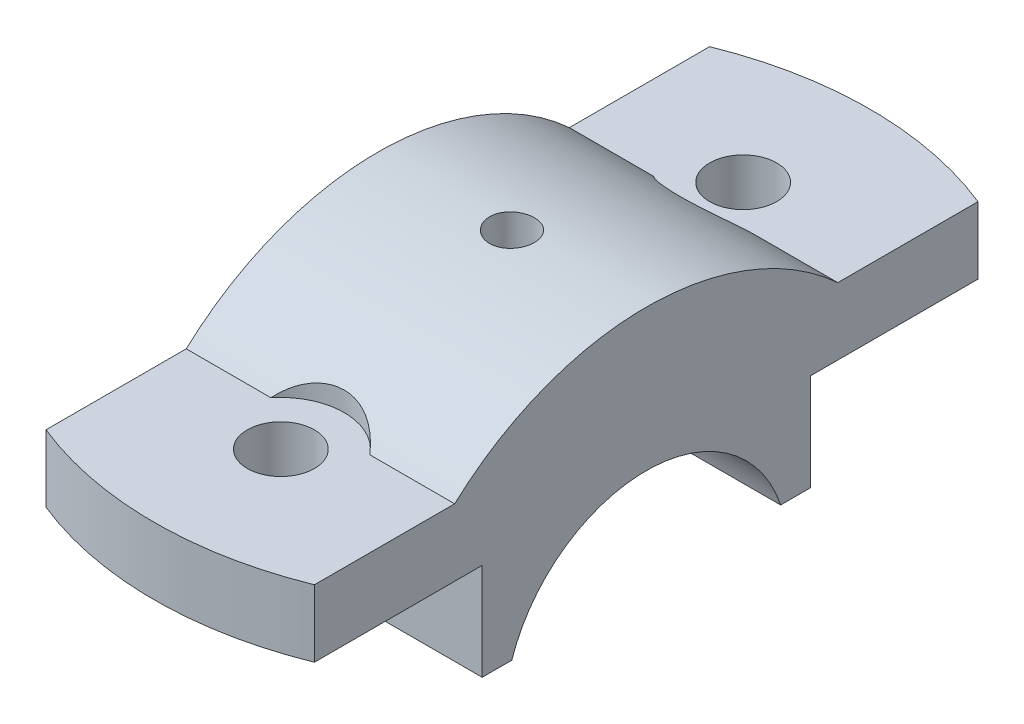
ISO-10303-21;
HEADER;
FILE_DESCRIPTION(('STEP AP214'),'2;1');
FILE_NAME('part.step','',(''),(''),'','','');
FILE_SCHEMA(('AUTOMOTIVE_DESIGN { 1 0 10303 214 1 1 1 1 }'));
ENDSEC;
DATA;
#1=APPLICATION_CONTEXT('core data for automotive mechanical design processes');
#2=APPLICATION_PROTOCOL_DEFINITION('international standard','automotive_design',2000,#1);
#3=PRODUCT_CONTEXT('',#1,'mechanical');
#4=PRODUCT('Part','Part','',(#3));
#5=PRODUCT_RELATED_PRODUCT_CATEGORY('part','',(#4));
#6=PRODUCT_DEFINITION_FORMATION('','',#4);
#7=PRODUCT_DEFINITION_CONTEXT('part definition',#1,'design');
#8=PRODUCT_DEFINITION('design','',#6,#7);
#9=PRODUCT_DEFINITION_SHAPE('','',#8);
#10=(LENGTH_UNIT() NAMED_UNIT(*) SI_UNIT(.MILLI.,.METRE.));
#11=(NAMED_UNIT(*) PLANE_ANGLE_UNIT() SI_UNIT($,.RADIAN.));
#12=(NAMED_UNIT(*) SI_UNIT($,.STERADIAN.) SOLID_ANGLE_UNIT());
#13=UNCERTAINTY_MEASURE_WITH_UNIT(LENGTH_MEASURE(1.E-05),#10,'distance_accuracy_value','');
#14=(GEOMETRIC_REPRESENTATION_CONTEXT(3) GLOBAL_UNCERTAINTY_ASSIGNED_CONTEXT((#13)) GLOBAL_UNIT_ASSIGNED_CONTEXT((#10,
#11,#12)) REPRESENTATION_CONTEXT('',''));
#15=CARTESIAN_POINT('',(0.,0.,0.));
#16=DIRECTION('',(0.,0.,1.));
#17=DIRECTION('',(1.,0.,0.));
#18=AXIS2_PLACEMENT_3D('',#15,#16,#17);
#19=CARTESIAN_POINT('',(18.,0.,0.));
#20=DIRECTION('',(-1.,0.,0.));
#21=DIRECTION('',(0.,0.,1.));
#22=AXIS2_PLACEMENT_3D('',#19,#20,#21);
#23=CYLINDRICAL_SURFACE('',#22,38.);
#24=CARTESIAN_POINT('',(0.,37.8813938497516,3.));
#25=CARTESIAN_POINT('',(-0.168229356223722,37.881395424836,2.99999263785231));
#26=CARTESIAN_POINT('',(-0.336574006245494,37.8825265582867,2.98580184849921));
#27=CARTESIAN_POINT('',(-0.668607649957892,37.8869289647691,2.92939974932901));
#28=CARTESIAN_POINT('',(-0.832291112499561,37.8902026781767,2.88715648723706));
#29=CARTESIAN_POINT('',(-1.1501452237575,37.8985171541647,2.77587681608235));
#30=CARTESIAN_POINT('',(-1.30432112294825,37.9035569309858,2.70685535144457));
#31=CARTESIAN_POINT('',(-1.59886160168987,37.9148344391245,2.54400458445207));
#32=CARTESIAN_POINT('',(-1.73922917388467,37.92107191,2.45018067379415));
#33=CARTESIAN_POINT('',(-2.00253137226757,37.9340582512773,2.24015280345187));
#34=CARTESIAN_POINT('',(-2.12542960763649,37.9408081455451,2.1239032815472));
#35=CARTESIAN_POINT('',(-2.34999209013841,37.9540493837728,1.87242010716811));
#36=CARTESIAN_POINT('',(-2.45165541954578,37.9605407165486,1.7371856346283));
#37=CARTESIAN_POINT('',(-2.63098168610704,37.9725429812434,1.45135636719248));
#38=CARTESIAN_POINT('',(-2.708613379424,37.9780526329515,1.3007419119018));
#39=CARTESIAN_POINT('',(-2.83747282349098,37.9874597537666,0.988565369760011));
#40=CARTESIAN_POINT('',(-2.88870099425837,37.9913572485189,0.82700345710322));
#41=CARTESIAN_POINT('',(-2.96319512715381,37.9970937704964,0.497878390626905));
#42=CARTESIAN_POINT('',(-2.98651964678537,37.998937107936,0.330328567016737));
#43=CARTESIAN_POINT('',(-3.0047253592679,38.0003722094706,-0.00631733654750849));
#44=CARTESIAN_POINT('',(-2.99960703233397,37.9999640115795,-0.17541339034767));
#45=CARTESIAN_POINT('',(-2.96112032248106,37.9969456003133,-0.509954787192965));
#46=CARTESIAN_POINT('',(-2.92781491240174,37.9943402955467,-0.675407425277911));
#47=CARTESIAN_POINT('',(-2.83399732705022,37.9872264182713,-0.998366668593193));
#48=CARTESIAN_POINT('',(-2.77348491551835,37.9827178292348,-1.1558732048081));
#49=CARTESIAN_POINT('',(-2.62690060373558,37.9722962502068,-1.45867002090717));
#50=CARTESIAN_POINT('',(-2.54080042217035,37.9663817077167,-1.6039465541759));
#51=CARTESIAN_POINT('',(-2.34550517866702,37.9538131184224,-1.87800944429183));
#52=CARTESIAN_POINT('',(-2.23630969705862,37.9471590581814,-2.00679550141832));
#53=CARTESIAN_POINT('',(-1.99756841972296,37.9338380622355,-2.24458971981856));
#54=CARTESIAN_POINT('',(-1.86796791907116,37.9271711409281,-2.35354296660022));
#55=CARTESIAN_POINT('',(-1.59228636571935,37.9145941321889,-2.54815472752467));
#56=CARTESIAN_POINT('',(-1.44620530136698,37.9086840452923,-2.63381322519709));
#57=CARTESIAN_POINT('',(-1.14167162060739,37.8982886351211,-2.77940144234371));
#58=CARTESIAN_POINT('',(-0.983217696466579,37.8938034627057,-2.83932843779762));
#59=CARTESIAN_POINT('',(-0.658454052626346,37.8867684945926,-2.93171253141031));
#60=CARTESIAN_POINT('',(-0.492144481013881,37.8842186624274,-2.96417014717686));
#61=CARTESIAN_POINT('',(-0.156870629588009,37.8813488492975,-3.00062486955394));
#62=CARTESIAN_POINT('',(0.0120852808075258,37.8810228729924,-3.00469849779479));
#63=CARTESIAN_POINT('',(0.348277674479458,37.8826218486592,-2.98446993701008));
#64=CARTESIAN_POINT('',(0.515514172114852,37.884546781818,-2.96016798514648));
#65=CARTESIAN_POINT('',(0.843301603254929,37.8904252096708,-2.88394184726827));
#66=CARTESIAN_POINT('',(1.00386086655318,37.8943760896121,-2.83205326228916));
#67=CARTESIAN_POINT('',(1.31399395677734,37.9038590548662,-2.70216294400362));
#68=CARTESIAN_POINT('',(1.46356762519929,37.9093911629879,-2.62416083401247));
#69=CARTESIAN_POINT('',(1.74783416137562,37.9214277776749,-2.44406357833825));
#70=CARTESIAN_POINT('',(1.88249459296493,37.9279343341079,-2.34191737427747));
#71=CARTESIAN_POINT('',(2.13278456634997,37.9411797159946,-2.11650535947003));
#72=CARTESIAN_POINT('',(2.2484138138424,37.9479185450382,-1.99323922217928));
#73=CARTESIAN_POINT('',(2.45761968980163,37.9608869464052,-1.72875604909499));
#74=CARTESIAN_POINT('',(2.55114664697588,37.9671153515116,-1.58749965829181));
#75=CARTESIAN_POINT('',(2.71315246287969,37.9783443227055,-1.29124223392211));
#76=CARTESIAN_POINT('',(2.78163154976985,37.9833448999771,-1.13624132557013));
#77=CARTESIAN_POINT('',(2.8915121915042,37.9915493740706,-0.817073838218851));
#78=CARTESIAN_POINT('',(2.93294463032733,37.9947553195452,-0.65291794650694));
#79=CARTESIAN_POINT('',(2.98765683143964,37.9990175942321,-0.319953232508928));
#80=CARTESIAN_POINT('',(3.00093706657949,38.0000739595491,-0.151144488421414));
#81=CARTESIAN_POINT('',(2.99896261174756,37.9999181203354,0.185844007724725));
#82=CARTESIAN_POINT('',(2.98378540562109,37.9987120758837,0.354024222061251));
#83=CARTESIAN_POINT('',(2.92548825985853,37.9941791393791,0.685439460070173));
#84=CARTESIAN_POINT('',(2.88236827921959,37.9908522442142,0.848674476485685));
#85=CARTESIAN_POINT('',(2.76942883565186,37.9824510315142,1.16557212517757));
#86=CARTESIAN_POINT('',(2.69961054075428,37.9773767904253,1.3192351758783));
#87=CARTESIAN_POINT('',(2.53526551305572,37.9660490429656,1.61267080850138));
#88=CARTESIAN_POINT('',(2.44073922912224,37.9597955580186,1.7524436427022));
#89=CARTESIAN_POINT('',(2.22937105364119,37.9467913112365,2.01452730784427));
#90=CARTESIAN_POINT('',(2.11247200370349,37.9400393035084,2.13679197870458));
#91=CARTESIAN_POINT('',(1.85977604977668,37.926809547746,2.3600119308789));
#92=CARTESIAN_POINT('',(1.72397456524185,37.9203318666858,2.46096203215627));
#93=CARTESIAN_POINT('',(1.43709086811672,37.9083720300883,2.63880908526894));
#94=CARTESIAN_POINT('',(1.28598273615028,37.9028916086487,2.71566430398236));
#95=CARTESIAN_POINT('',(0.97306834736823,37.8935681492736,2.84281465262269));
#96=CARTESIAN_POINT('',(0.811274688620423,37.8897232215665,2.89314045280837));
#97=CARTESIAN_POINT('',(0.54043166318695,37.8850993601198,2.95292421077471));
#98=CARTESIAN_POINT('',(0.433126408915516,37.8837161394621,2.97055431578336));
#99=CARTESIAN_POINT('',(0.217230128113446,37.8818628767795,2.99409457369404));
#100=CARTESIAN_POINT('',(0.10863910462557,37.8813928325941,3.00000475432558));
#101=CARTESIAN_POINT('',(0.,37.8813938497516,3.));
#102=B_SPLINE_CURVE_WITH_KNOTS('',3,(#24,#25,#26,#27,#28,#29,#30,#31,#32,#33,#34,#35,#36,#37,
#38,#39,#40,#41,#42,#43,#44,#45,#46,#47,#48,#49,#50,#51,#52,#53,#54,#55,#56,#57,#58,#59,#60,#61,
#62,#63,#64,#65,#66,#67,#68,#69,#70,#71,#72,#73,#74,#75,#76,#77,#78,#79,#80,#81,#82,#83,#84,#85,
#86,#87,#88,#89,#90,#91,#92,#93,#94,#95,#96,#97,#98,#99,#100,#101),.UNSPECIFIED.,.T.,.F.,(4,2,2,
2,2,2,2,2,2,2,2,2,2,2,2,2,2,2,2,2,2,2,2,2,2,2,2,2,2,2,2,2,2,2,2,2,2,2,4),(0.,0.504291421669989,
1.00915822788302,1.51374368152857,2.01821953559138,2.52373134073237,3.02926498845646,
3.53545315301367,4.04163326507021,4.546749253583,5.05185671399058,5.55583868228782,
6.05982502713928,6.56437049631086,7.06892513448829,7.5748562462125,8.08078771565083,
8.58677273143866,9.09274821269729,9.59735908295555,10.1019657357268,10.6059227598395,
11.10988705379,11.6149267875576,12.1199743306602,12.6261463157288,13.1323136899712,
13.6379020669613,14.1434819519093,14.6476872439429,15.1518932758423,15.6560772516295,
16.1602520685946,16.6657325841807,17.1713358046312,17.6778099691558,18.1836973153047,
18.5093592531183,18.8350204204102),.UNSPECIFIED.);
#103=CARTESIAN_POINT('',(0.,37.8813938497516,3.));
#104=VERTEX_POINT('',#103);
#105=EDGE_CURVE('E11',#104,#104,#102,.T.);
#106=ORIENTED_EDGE('',*,*,#105,.T.);
#107=EDGE_LOOP('',(#106));
#108=FACE_BOUND('',#107,.T.);
#109=CARTESIAN_POINT('',(-6.63768331230678,28.,-25.6904651573302));
#110=CARTESIAN_POINT('',(-6.51420867249735,28.1416681018721,-25.5360851043423));
#111=CARTESIAN_POINT('',(-6.38340380017066,28.2791823336498,-25.3836215551735));
#112=CARTESIAN_POINT('',(-6.10685950724569,28.5451833866574,-25.0841053598261));
#113=CARTESIAN_POINT('',(-5.96110576476092,28.6736613482156,-24.9370580895264));
#114=CARTESIAN_POINT('',(-5.65349144226199,28.9215085426633,-24.6491941230388));
#115=CARTESIAN_POINT('',(-5.49151942353938,29.0408031542342,-24.508431723833));
#116=CARTESIAN_POINT('',(-5.15263687836668,29.2682904084011,-24.2363075607749));
#117=CARTESIAN_POINT('',(-4.9757306926307,29.3764862568108,-24.1049430857226));
#118=CARTESIAN_POINT('',(-4.60631493821571,29.5815743674557,-23.8528205053459));
#119=CARTESIAN_POINT('',(-4.41371469093333,29.6783916917416,-23.7321338833277));
#120=CARTESIAN_POINT('',(-4.01479632179464,29.85908164754,-23.5043908446779));
#121=CARTESIAN_POINT('',(-3.80847672492269,29.942952883943,-23.3973358972541));
#122=CARTESIAN_POINT('',(-3.38422419101504,30.0966827286364,-23.1992536300817));
#123=CARTESIAN_POINT('',(-3.1663331999127,30.1665880882949,-23.1081729651954));
#124=CARTESIAN_POINT('',(-2.72008092153074,30.2920447623401,-22.9434688496595));
#125=CARTESIAN_POINT('',(-2.49172164276593,30.347598816803,-22.869842066784));
#126=CARTESIAN_POINT('',(-2.05682098381956,30.4375648556656,-22.7499342032063));
#127=CARTESIAN_POINT('',(-1.85128534823191,30.4737833576563,-22.7013462567531));
#128=CARTESIAN_POINT('',(-1.43551725204115,30.534645499234,-22.6194172898017));
#129=CARTESIAN_POINT('',(-1.22528524633891,30.5592902548309,-22.5860747992536));
#130=CARTESIAN_POINT('',(-0.801799591498531,30.5968164834569,-22.5352129551669));
#131=CARTESIAN_POINT('',(-0.588544891193925,30.6096937569973,-22.5176992505084));
#132=CARTESIAN_POINT('',(-0.160939560666238,30.6235658271181,-22.4988301660851));
#133=CARTESIAN_POINT('',(0.053411009051129,30.624561272785,-22.4974739036633));
#134=CARTESIAN_POINT('',(0.461997479818145,30.6151119876344,-22.5103301119086));
#135=CARTESIAN_POINT('',(0.656303160135771,30.6056914251709,-22.5231488228924));
#136=CARTESIAN_POINT('',(1.04286259298841,30.5770763766543,-22.5619809221014));
#137=CARTESIAN_POINT('',(1.23511639873688,30.5578821447042,-22.5879939672906));
#138=CARTESIAN_POINT('',(1.61613906729809,30.5098574663833,-22.6528192304938));
#139=CARTESIAN_POINT('',(1.80490939654948,30.4810311771979,-22.6916259266854));
#140=CARTESIAN_POINT('',(2.17779604427593,30.4139289484325,-22.7814851533843));
#141=CARTESIAN_POINT('',(2.36191225066402,30.3756527815061,-22.8325379785097));
#142=CARTESIAN_POINT('',(2.72495933677602,30.2897519777021,-22.9463727274414));
#143=CARTESIAN_POINT('',(2.90387039063446,30.2420959034169,-23.0091940590921));
#144=CARTESIAN_POINT('',(3.25489148863349,30.1378044455699,-23.1456283742011));
#145=CARTESIAN_POINT('',(3.42699921914349,30.0811660396201,-23.2192449894415));
#146=CARTESIAN_POINT('',(3.76349373210636,29.9592695660633,-23.3763137314078));
#147=CARTESIAN_POINT('',(3.92788033882065,29.8940113023904,-23.4597660818508));
#148=CARTESIAN_POINT('',(4.24828704232642,29.7552415450916,-23.6355270453779));
#149=CARTESIAN_POINT('',(4.40430414494655,29.6817271265587,-23.7278387953854));
#150=CARTESIAN_POINT('',(4.71995510834891,29.5204551498758,-23.9282386479047));
#151=CARTESIAN_POINT('',(4.87881602386905,29.432022004933,-24.0370002176616));
#152=CARTESIAN_POINT('',(5.1856332961988,29.2465042091278,-24.2623844714665));
#153=CARTESIAN_POINT('',(5.33358477081362,29.1494157272481,-24.379010630913));
#154=CARTESIAN_POINT('',(5.61815393006346,28.9472618083659,-24.6187042069683));
#155=CARTESIAN_POINT('',(5.75477915839727,28.8422017715012,-24.7417672458198));
#156=CARTESIAN_POINT('',(6.016738259449,28.6246099475779,-24.9931857635632));
#157=CARTESIAN_POINT('',(6.14207215863705,28.5120781780363,-25.121541230047));
#158=CARTESIAN_POINT('',(6.32788833390874,28.3320696328102,-25.3239635142993));
#159=CARTESIAN_POINT('',(6.39227987552884,28.2669811541268,-25.3966039536003));
#160=CARTESIAN_POINT('',(6.51755974656749,28.1349133065772,-25.5428336292653));
#161=CARTESIAN_POINT('',(6.57845434819234,28.0679376662269,-25.6164208573993));
#162=CARTESIAN_POINT('',(6.63768331230705,28.0000000000002,-25.6904651573302));
#163=B_SPLINE_CURVE_WITH_KNOTS('',3,(#109,#110,#111,#112,#113,#114,#115,#116,#117,#118,#119,
#120,#121,#122,#123,#124,#125,#126,#127,#128,#129,#130,#131,#132,#133,#134,#135,#136,#137,#138,
#139,#140,#141,#142,#143,#144,#145,#146,#147,#148,#149,#150,#151,#152,#153,#154,#155,#156,#157,
#158,#159,#160,#161,#162),.UNSPECIFIED.,.F.,.F.,(4,2,2,2,2,2,2,2,2,2,2,2,2,2,2,2,2,2,2,2,2,2,2,
2,2,2,4),(0.,0.729592400834069,1.45989044138351,2.19560470883997,2.93110586753774,
3.67120763552796,4.4113891035264,5.14904966030394,5.88656927223677,6.52855006409982,
7.17046893961486,7.81261680885217,8.45472959834443,9.03890309081729,9.62306139629811,
10.2069679046447,10.7908884620571,11.3768004587137,11.9629100238154,12.549032922753,
13.1353641263273,13.7703169673958,14.4055522594533,15.040361004022,15.6751682603777,
16.0257258218313,16.3756336015193),.UNSPECIFIED.);
#164=CARTESIAN_POINT('',(-6.6376833123068,28.,-25.6904651573303));
#165=VERTEX_POINT('',#164);
#166=CARTESIAN_POINT('',(6.6376833123068,28.,-25.6904651573303));
#167=VERTEX_POINT('',#166);
#168=EDGE_CURVE('E249',#165,#167,#163,.T.);
#169=ORIENTED_EDGE('',*,*,#168,.F.);
#170=DIRECTION('',(-1.,0.,0.));
#171=VECTOR('',#170,1.);
#172=CARTESIAN_POINT('',(18.,28.,-25.6904651573303));
#173=LINE('',#172,#171);
#174=CARTESIAN_POINT('',(-18.,28.,-25.6904651573303));
#175=VERTEX_POINT('',#174);
#176=EDGE_CURVE('E193',#165,#175,#173,.T.);
#177=ORIENTED_EDGE('',*,*,#176,.T.);
#178=CARTESIAN_POINT('',(-18.,0.,0.));
#179=DIRECTION('',(1.,0.,0.));
#180=DIRECTION('',(0.,0.,-1.));
#181=AXIS2_PLACEMENT_3D('',#178,#179,#180);
#182=CIRCLE('',#181,38.);
#183=CARTESIAN_POINT('',(-18.,28.,25.6904651573303));
#184=VERTEX_POINT('',#183);
#185=EDGE_CURVE('E161',#175,#184,#182,.T.);
#186=ORIENTED_EDGE('',*,*,#185,.T.);
#187=DIRECTION('',(-1.,0.,0.));
#188=VECTOR('',#187,1.);
#189=CARTESIAN_POINT('',(18.,28.,25.6904651573303));
#190=LINE('',#189,#188);
#191=CARTESIAN_POINT('',(-6.6376833123068,28.,25.6904651573303));
#192=VERTEX_POINT('',#191);
#193=EDGE_CURVE('E189',#192,#184,#190,.T.);
#194=ORIENTED_EDGE('',*,*,#193,.F.);
#195=CARTESIAN_POINT('',(6.63768331230678,28.,25.6904651573303));
#196=CARTESIAN_POINT('',(6.51420867249735,28.1416681018721,25.5360851043423));
#197=CARTESIAN_POINT('',(6.38340380017067,28.2791823336498,25.3836215551735));
#198=CARTESIAN_POINT('',(6.10685950724569,28.5451833866574,25.0841053598261));
#199=CARTESIAN_POINT('',(5.96110576476092,28.6736613482156,24.9370580895264));
#200=CARTESIAN_POINT('',(5.65349144226199,28.9215085426633,24.6491941230388));
#201=CARTESIAN_POINT('',(5.49151942353938,29.0408031542341,24.508431723833));
#202=CARTESIAN_POINT('',(5.15263687836668,29.2682904084011,24.2363075607749));
#203=CARTESIAN_POINT('',(4.9757306926307,29.3764862568107,24.1049430857226));
#204=CARTESIAN_POINT('',(4.60631493821571,29.5815743674557,23.8528205053459));
#205=CARTESIAN_POINT('',(4.41371469093333,29.6783916917415,23.7321338833277));
#206=CARTESIAN_POINT('',(4.01479632179464,29.85908164754,23.5043908446779));
#207=CARTESIAN_POINT('',(3.80847672492269,29.942952883943,23.3973358972541));
#208=CARTESIAN_POINT('',(3.38422419101504,30.0966827286364,23.1992536300817));
#209=CARTESIAN_POINT('',(3.1663331999127,30.1665880882949,23.1081729651954));
#210=CARTESIAN_POINT('',(2.72008092153074,30.2920447623401,22.9434688496595));
#211=CARTESIAN_POINT('',(2.49172164276593,30.347598816803,22.869842066784));
#212=CARTESIAN_POINT('',(2.05682098381956,30.4375648556656,22.7499342032063));
#213=CARTESIAN_POINT('',(1.85128534823192,30.4737833576563,22.7013462567531));
#214=CARTESIAN_POINT('',(1.43551725204115,30.534645499234,22.6194172898017));
#215=CARTESIAN_POINT('',(1.22528524633891,30.5592902548309,22.5860747992536));
#216=CARTESIAN_POINT('',(0.801799591498532,30.5968164834569,22.5352129551669));
#217=CARTESIAN_POINT('',(0.588544891193925,30.6096937569973,22.5176992505084));
#218=CARTESIAN_POINT('',(0.160939560666237,30.6235658271181,22.4988301660851));
#219=CARTESIAN_POINT('',(-0.0534110090511306,30.624561272785,22.4974739036633));
#220=CARTESIAN_POINT('',(-0.461997479818147,30.6151119876343,22.5103301119086));
#221=CARTESIAN_POINT('',(-0.656303160135773,30.6056914251709,22.5231488228924));
#222=CARTESIAN_POINT('',(-1.04286259298841,30.5770763766543,22.5619809221014));
#223=CARTESIAN_POINT('',(-1.23511639873688,30.5578821447042,22.5879939672906));
#224=CARTESIAN_POINT('',(-1.61613906729809,30.5098574663833,22.6528192304938));
#225=CARTESIAN_POINT('',(-1.80490939654948,30.4810311771979,22.6916259266854));
#226=CARTESIAN_POINT('',(-2.17779604427594,30.4139289484325,22.7814851533843));
#227=CARTESIAN_POINT('',(-2.36191225066402,30.3756527815061,22.8325379785097));
#228=CARTESIAN_POINT('',(-2.72495933677602,30.2897519777021,22.9463727274414));
#229=CARTESIAN_POINT('',(-2.90387039063446,30.2420959034169,23.0091940590921));
#230=CARTESIAN_POINT('',(-3.25489148863349,30.1378044455698,23.1456283742011));
#231=CARTESIAN_POINT('',(-3.42699921914349,30.0811660396201,23.2192449894415));
#232=CARTESIAN_POINT('',(-3.76349373210636,29.9592695660632,23.3763137314078));
#233=CARTESIAN_POINT('',(-3.92788033882065,29.8940113023904,23.4597660818508));
#234=CARTESIAN_POINT('',(-4.24828704232642,29.7552415450916,23.635527045378));
#235=CARTESIAN_POINT('',(-4.40430414494655,29.6817271265587,23.7278387953854));
#236=CARTESIAN_POINT('',(-4.71995510834891,29.5204551498758,23.9282386479047));
#237=CARTESIAN_POINT('',(-4.87881602386905,29.432022004933,24.0370002176616));
#238=CARTESIAN_POINT('',(-5.18563329619879,29.2465042091278,24.2623844714665));
#239=CARTESIAN_POINT('',(-5.33358477081362,29.1494157272481,24.379010630913));
#240=CARTESIAN_POINT('',(-5.61815393006346,28.9472618083659,24.6187042069683));
#241=CARTESIAN_POINT('',(-5.75477915839727,28.8422017715012,24.7417672458198));
#242=CARTESIAN_POINT('',(-6.016738259449,28.6246099475779,24.9931857635632));
#243=CARTESIAN_POINT('',(-6.14207215863704,28.5120781780363,25.121541230047));
#244=CARTESIAN_POINT('',(-6.32788833390873,28.3320696328102,25.3239635142993));
#245=CARTESIAN_POINT('',(-6.39227987552884,28.2669811541268,25.3966039536003));
#246=CARTESIAN_POINT('',(-6.51755974656749,28.1349133065772,25.5428336292653));
#247=CARTESIAN_POINT('',(-6.57845434819234,28.0679376662269,25.6164208573993));
#248=CARTESIAN_POINT('',(-6.63768331230705,28.0000000000002,25.6904651573302));
#249=B_SPLINE_CURVE_WITH_KNOTS('',3,(#195,#196,#197,#198,#199,#200,#201,#202,#203,#204,#205,
#206,#207,#208,#209,#210,#211,#212,#213,#214,#215,#216,#217,#218,#219,#220,#221,#222,#223,#224,
#225,#226,#227,#228,#229,#230,#231,#232,#233,#234,#235,#236,#237,#238,#239,#240,#241,#242,#243,
#244,#245,#246,#247,#248),.UNSPECIFIED.,.F.,.F.,(4,2,2,2,2,2,2,2,2,2,2,2,2,2,2,2,2,2,2,2,2,2,2,
2,2,2,4),(0.,0.729592400834068,1.45989044138351,2.19560470883998,2.93110586753774,
3.67120763552797,4.41138910352641,5.14904966030395,5.88656927223677,6.52855006409982,
7.17046893961487,7.81261680885218,8.45472959834444,9.0389030908173,9.62306139629812,
10.2069679046447,10.7908884620571,11.3768004587137,11.9629100238154,12.549032922753,
13.1353641263273,13.7703169673958,14.4055522594533,15.040361004022,15.6751682603777,
16.0257258218313,16.3756336015193),.UNSPECIFIED.);
#250=CARTESIAN_POINT('',(6.6376833123068,28.,25.6904651573303));
#251=VERTEX_POINT('',#250);
#252=EDGE_CURVE('E260',#251,#192,#249,.T.);
#253=ORIENTED_EDGE('',*,*,#252,.F.);
#254=CARTESIAN_POINT('',(18.,28.,25.6904651573303));
#255=VERTEX_POINT('',#254);
#256=EDGE_CURVE('E190',#255,#251,#190,.T.);
#257=ORIENTED_EDGE('',*,*,#256,.F.);
#258=CARTESIAN_POINT('',(18.,0.,0.));
#259=DIRECTION('',(1.,0.,0.));
#260=DIRECTION('',(0.,0.,-1.));
#261=AXIS2_PLACEMENT_3D('',#258,#259,#260);
#262=CIRCLE('',#261,38.);
#263=CARTESIAN_POINT('',(18.,28.,-25.6904651573303));
#264=VERTEX_POINT('',#263);
#265=EDGE_CURVE('E284',#264,#255,#262,.T.);
#266=ORIENTED_EDGE('',*,*,#265,.F.);
#267=EDGE_CURVE('E194',#264,#167,#173,.T.);
#268=ORIENTED_EDGE('',*,*,#267,.T.);
#269=EDGE_LOOP('',(#169,#177,#186,#194,#253,#257,#266,#268));
#270=FACE_BOUND('',#269,.T.);
#271=ADVANCED_FACE('F33',(#108,#270),#23,.T.);
#272=CARTESIAN_POINT('',(18.,0.,0.));
#273=DIRECTION('',(-1.,0.,0.));
#274=DIRECTION('',(0.,0.,1.));
#275=AXIS2_PLACEMENT_3D('',#272,#273,#274);
#276=CYLINDRICAL_SURFACE('',#275,19.);
#277=CARTESIAN_POINT('',(0.,18.8348082018374,2.49999999999999));
#278=CARTESIAN_POINT('',(0.139772410707228,18.8348103005537,2.49999409578524));
#279=CARTESIAN_POINT('',(0.279630654917696,18.8363808783556,2.48823862932085));
#280=CARTESIAN_POINT('',(0.555450449604444,18.8424906592257,2.44153211686149));
#281=CARTESIAN_POINT('',(0.691407844841227,18.847032913542,2.40655722916087));
#282=CARTESIAN_POINT('',(0.955392840298785,18.8585628581225,2.31446464350121));
#283=CARTESIAN_POINT('',(1.08342592246777,18.865548835081,2.25736245608321));
#284=CARTESIAN_POINT('',(1.32807015559524,18.8811770275024,2.12267026806168));
#285=CARTESIAN_POINT('',(1.44468316098251,18.8898189733878,2.0450836013815));
#286=CARTESIAN_POINT('',(1.66392100396941,18.9078452303947,1.87111107289513));
#287=CARTESIAN_POINT('',(1.7664649447672,18.9172333815059,1.77462365227276));
#288=CARTESIAN_POINT('',(1.95395445346304,18.9356597775486,1.56580738299605));
#289=CARTESIAN_POINT('',(2.03889912384395,18.9446980046158,1.45347772691953));
#290=CARTESIAN_POINT('',(2.1890712575453,18.9614457365025,1.21565447428568));
#291=CARTESIAN_POINT('',(2.25422515928236,18.9691502393822,1.09011404546435));
#292=CARTESIAN_POINT('',(2.36249489410533,18.9823201413144,0.829754686720082));
#293=CARTESIAN_POINT('',(2.40561162986091,18.9877856320778,0.694936137097196));
#294=CARTESIAN_POINT('',(2.46834044520401,18.9958346390645,0.42067662694127));
#295=CARTESIAN_POINT('',(2.48808731176756,18.998434675905,0.281266987599393));
#296=CARTESIAN_POINT('',(2.50393376893561,19.0005162894914,0.00109010892107149));
#297=CARTESIAN_POINT('',(2.50003438449259,18.9999980014017,-0.139677071308373));
#298=CARTESIAN_POINT('',(2.46880664147129,18.9959146873145,-0.417655495625261));
#299=CARTESIAN_POINT('',(2.44162325419791,18.9923685140246,-0.554883341583922));
#300=CARTESIAN_POINT('',(2.36482599286765,18.9826489891627,-0.822812428692208));
#301=CARTESIAN_POINT('',(2.31521165393021,18.9764755831415,-0.953513534513066));
#302=CARTESIAN_POINT('',(2.19480811452032,18.9621627474723,-1.20512535683873));
#303=CARTESIAN_POINT('',(2.12395659803213,18.9540175457263,-1.32600591164241));
#304=CARTESIAN_POINT('',(1.96313528742037,18.9366715492133,-1.55421628813349));
#305=CARTESIAN_POINT('',(1.87316452226583,18.9274707008429,-1.66154542112792));
#306=CARTESIAN_POINT('',(1.67584774631525,18.9089599960683,-1.86045869817727));
#307=CARTESIAN_POINT('',(1.5683753315042,18.8996498417821,-1.95191747053696));
#308=CARTESIAN_POINT('',(1.33953904763814,18.8820383954162,-2.11551832656893));
#309=CARTESIAN_POINT('',(1.21817512611544,18.8737371071471,-2.18766033727908));
#310=CARTESIAN_POINT('',(0.964884545898979,18.8590834811492,-2.3105893747748));
#311=CARTESIAN_POINT('',(0.832952614660604,18.8527321240046,-2.36136566187571));
#312=CARTESIAN_POINT('',(0.562332271850076,18.8427161416511,-2.4400070674317));
#313=CARTESIAN_POINT('',(0.423644222854373,18.8390513724318,-2.46787341394892));
#314=CARTESIAN_POINT('',(0.144557770604838,18.8348501026747,-2.4997364331773));
#315=CARTESIAN_POINT('',(0.00417988267501979,18.8342904384187,-2.50390985775509));
#316=CARTESIAN_POINT('',(-0.275273112895704,18.8363014282045,-2.48873557934184));
#317=CARTESIAN_POINT('',(-0.414348251309536,18.8388720081163,-2.46938843336154));
#318=CARTESIAN_POINT('',(-0.686713845320678,18.8468326765771,-2.4078713017442));
#319=CARTESIAN_POINT('',(-0.820024106929613,18.8522121143748,-2.36578750914763));
#320=CARTESIAN_POINT('',(-1.07769659074713,18.8651757043717,-2.26008064221151));
#321=CARTESIAN_POINT('',(-1.20205846641077,18.8727599418992,-2.19645673422975));
#322=CARTESIAN_POINT('',(-1.43910187947633,18.8893338461434,-2.04904355294262));
#323=CARTESIAN_POINT('',(-1.55171099776969,18.8983314583415,-1.96513873634294));
#324=CARTESIAN_POINT('',(-1.76131206225707,18.9166936217277,-1.77970815022903));
#325=CARTESIAN_POINT('',(-1.8583033335243,18.926058188752,-1.67818161958444));
#326=CARTESIAN_POINT('',(-2.03453978862285,18.9441705799359,-1.45961588711243));
#327=CARTESIAN_POINT('',(-2.11366858191608,18.9529141182398,-1.34248242957225));
#328=CARTESIAN_POINT('',(-2.25112719879752,18.9687346092958,-1.09648411237258));
#329=CARTESIAN_POINT('',(-2.30945747987743,18.9758115987048,-0.967619510833922));
#330=CARTESIAN_POINT('',(-2.40347261332034,18.9874826488638,-0.702197878857102));
#331=CARTESIAN_POINT('',(-2.43922383380948,18.9920839805179,-0.565664689717643));
#332=CARTESIAN_POINT('',(-2.48728165155039,18.9983155475114,-0.288468615416634));
#333=CARTESIAN_POINT('',(-2.49958942615497,18.9999459320545,-0.147805938002306));
#334=CARTESIAN_POINT('',(-2.50038732371433,19.0000510083828,0.132521661638359));
#335=CARTESIAN_POINT('',(-2.48905656815023,18.9985494326839,0.272186098802337));
#336=CARTESIAN_POINT('',(-2.44327953837194,18.9926066364398,0.547606882566134));
#337=CARTESIAN_POINT('',(-2.40883329286806,18.9881654195457,0.683363234019725));
#338=CARTESIAN_POINT('',(-2.31786118504363,18.9768400549043,0.947084347123997));
#339=CARTESIAN_POINT('',(-2.26134485895363,18.969956962381,1.07505244642358));
#340=CARTESIAN_POINT('',(-2.12785549941422,18.9545084892845,1.31971689824451));
#341=CARTESIAN_POINT('',(-2.05088211706991,18.94594308002,1.43641305847676));
#342=CARTESIAN_POINT('',(-1.87800438938243,18.9280077185042,1.65613473301187));
#343=CARTESIAN_POINT('',(-1.78196696135376,18.9186323881523,1.75905510552541));
#344=CARTESIAN_POINT('',(-1.57396529634802,18.9001761775766,1.94738775545751));
#345=CARTESIAN_POINT('',(-1.46199730315986,18.8910953674186,2.03279589210142));
#346=CARTESIAN_POINT('',(-1.22475904167364,18.8742148988462,2.1839968177649));
#347=CARTESIAN_POINT('',(-1.09943390887033,18.8664208881083,2.24970411848513));
#348=CARTESIAN_POINT('',(-0.839492467959365,18.85306260999,2.35904458082509));
#349=CARTESIAN_POINT('',(-0.704886329967059,18.8474959460153,2.40270148171341));
#350=CARTESIAN_POINT('',(-0.474670862248904,18.8405583157814,2.45638258319662));
#351=CARTESIAN_POINT('',(-0.380506812944518,18.8384129295943,2.47271523019389));
#352=CARTESIAN_POINT('',(-0.19090851784083,18.8355371620448,2.49452590747469));
#353=CARTESIAN_POINT('',(-0.0954742831927987,18.8348067682681,2.50000403298954));
#354=CARTESIAN_POINT('',(0.,18.8348082018374,2.49999999999999));
#355=B_SPLINE_CURVE_WITH_KNOTS('',3,(#277,#278,#279,#280,#281,#282,#283,#284,#285,#286,#287,
#288,#289,#290,#291,#292,#293,#294,#295,#296,#297,#298,#299,#300,#301,#302,#303,#304,#305,#306,
#307,#308,#309,#310,#311,#312,#313,#314,#315,#316,#317,#318,#319,#320,#321,#322,#323,#324,#325,
#326,#327,#328,#329,#330,#331,#332,#333,#334,#335,#336,#337,#338,#339,#340,#341,#342,#343,#344,
#345,#346,#347,#348,#349,#350,#351,#352,#353,#354),.UNSPECIFIED.,.T.,.F.,(4,2,2,2,2,2,2,2,2,2,2,
2,2,2,2,2,2,2,2,2,2,2,2,2,2,2,2,2,2,2,2,2,2,2,2,2,2,2,4),(0.,0.418968405157234,
0.838367673884206,1.25747348717214,1.67651113147086,2.09786539850394,2.5192411482254,
2.94216449298394,3.36507051288868,3.78552532472134,4.20596191196856,4.62379964025607,
5.0416460286104,5.46073070560077,5.87983667220913,6.30211603448238,6.72439699174149,
7.14688995971333,7.56936027893768,7.98867473820329,8.40797926751844,8.82570528325036,
9.24344746759815,9.66362813695489,10.0838269595902,10.5066894380017,10.9295426144014,
11.3511470138381,11.7727302393306,12.1911305153045,12.6095302716104,13.0277494418252,
13.4459757452216,13.8672313515222,14.2885864492938,14.7117443270811,15.1344456605117,
15.4206327478507,15.7068173243377),.UNSPECIFIED.);
#356=CARTESIAN_POINT('',(0.,18.8348082018374,2.49999999999999));
#357=VERTEX_POINT('',#356);
#358=EDGE_CURVE('E38',#357,#357,#355,.T.);
#359=ORIENTED_EDGE('',*,*,#358,.T.);
#360=EDGE_LOOP('',(#359));
#361=FACE_BOUND('',#360,.T.);
#362=CARTESIAN_POINT('',(-18.,0.,0.));
#363=DIRECTION('',(-1.,0.,0.));
#364=DIRECTION('',(0.,0.,-1.));
#365=AXIS2_PLACEMENT_3D('',#362,#363,#364);
#366=CIRCLE('',#365,19.);
#367=CARTESIAN_POINT('',(-18.,6.,18.02775637732));
#368=VERTEX_POINT('',#367);
#369=CARTESIAN_POINT('',(-18.,6.,-18.0277563773199));
#370=VERTEX_POINT('',#369);
#371=EDGE_CURVE('E273',#368,#370,#366,.T.);
#372=ORIENTED_EDGE('',*,*,#371,.T.);
#373=DIRECTION('',(-1.,0.,0.));
#374=VECTOR('',#373,1.);
#375=CARTESIAN_POINT('',(18.,6.,-18.0277563773199));
#376=LINE('',#375,#374);
#377=CARTESIAN_POINT('',(18.,6.,-18.0277563773199));
#378=VERTEX_POINT('',#377);
#379=EDGE_CURVE('E203',#378,#370,#376,.T.);
#380=ORIENTED_EDGE('',*,*,#379,.F.);
#381=CARTESIAN_POINT('',(18.,0.,0.));
#382=DIRECTION('',(-1.,0.,0.));
#383=DIRECTION('',(0.,0.,-1.));
#384=AXIS2_PLACEMENT_3D('',#381,#382,#383);
#385=CIRCLE('',#384,19.);
#386=CARTESIAN_POINT('',(18.,6.,18.02775637732));
#387=VERTEX_POINT('',#386);
#388=EDGE_CURVE('E178',#387,#378,#385,.T.);
#389=ORIENTED_EDGE('',*,*,#388,.F.);
#390=DIRECTION('',(-1.,0.,0.));
#391=VECTOR('',#390,1.);
#392=CARTESIAN_POINT('',(18.,6.,18.02775637732));
#393=LINE('',#392,#391);
#394=EDGE_CURVE('E179',#387,#368,#393,.T.);
#395=ORIENTED_EDGE('',*,*,#394,.T.);
#396=EDGE_LOOP('',(#372,#380,#389,#395));
#397=FACE_BOUND('',#396,.T.);
#398=ADVANCED_FACE('F35',(#361,#397),#276,.F.);
#399=CARTESIAN_POINT('',(18.,6.,-18.0277563773199));
#400=DIRECTION('',(0.,1.,0.));
#401=DIRECTION('',(0.,0.,1.));
#402=AXIS2_PLACEMENT_3D('',#399,#400,#401);
#403=PLANE('',#402);
#404=DIRECTION('',(0.,0.,-1.));
#405=VECTOR('',#404,1.);
#406=CARTESIAN_POINT('',(-18.,6.,-18.0277563773199));
#407=LINE('',#406,#405);
#408=CARTESIAN_POINT('',(-18.,6.,-22.));
#409=VERTEX_POINT('',#408);
#410=EDGE_CURVE('E296',#370,#409,#407,.T.);
#411=ORIENTED_EDGE('',*,*,#410,.T.);
#412=DIRECTION('',(-1.,0.,0.));
#413=VECTOR('',#412,1.);
#414=CARTESIAN_POINT('',(18.,6.,-22.));
#415=LINE('',#414,#413);
#416=CARTESIAN_POINT('',(18.,6.,-22.));
#417=VERTEX_POINT('',#416);
#418=EDGE_CURVE('E200',#417,#409,#415,.T.);
#419=ORIENTED_EDGE('',*,*,#418,.F.);
#420=DIRECTION('',(0.,0.,-1.));
#421=VECTOR('',#420,1.);
#422=CARTESIAN_POINT('',(18.,6.,-18.0277563773199));
#423=LINE('',#422,#421);
#424=EDGE_CURVE('E276',#378,#417,#423,.T.);
#425=ORIENTED_EDGE('',*,*,#424,.F.);
#426=ORIENTED_EDGE('',*,*,#379,.T.);
#427=EDGE_LOOP('',(#411,#419,#425,#426));
#428=FACE_BOUND('',#427,.T.);
#429=ADVANCED_FACE('F311',(#428),#403,.F.);
#430=CARTESIAN_POINT('',(18.,6.,-22.));
#431=DIRECTION('',(0.,0.,1.));
#432=DIRECTION('',(0.,-1.,0.));
#433=AXIS2_PLACEMENT_3D('',#430,#431,#432);
#434=PLANE('',#433);
#435=DIRECTION('',(0.,1.,0.));
#436=VECTOR('',#435,1.);
#437=CARTESIAN_POINT('',(-18.,6.,-22.));
#438=LINE('',#437,#436);
#439=CARTESIAN_POINT('',(-18.,19.,-22.));
#440=VERTEX_POINT('',#439);
#441=EDGE_CURVE('E166',#409,#440,#438,.T.);
#442=ORIENTED_EDGE('',*,*,#441,.T.);
#443=DIRECTION('',(-1.,0.,0.));
#444=VECTOR('',#443,1.);
#445=CARTESIAN_POINT('',(18.,19.,-22.));
#446=LINE('',#445,#444);
#447=CARTESIAN_POINT('',(18.,19.,-22.));
#448=VERTEX_POINT('',#447);
#449=EDGE_CURVE('E197',#448,#440,#446,.T.);
#450=ORIENTED_EDGE('',*,*,#449,.F.);
#451=DIRECTION('',(0.,1.,0.));
#452=VECTOR('',#451,1.);
#453=CARTESIAN_POINT('',(18.,6.,-22.));
#454=LINE('',#453,#452);
#455=EDGE_CURVE('E278',#417,#448,#454,.T.);
#456=ORIENTED_EDGE('',*,*,#455,.F.);
#457=ORIENTED_EDGE('',*,*,#418,.T.);
#458=EDGE_LOOP('',(#442,#450,#456,#457));
#459=FACE_BOUND('',#458,.T.);
#460=ADVANCED_FACE('F300',(#459),#434,.F.);
#461=CARTESIAN_POINT('',(18.,19.,-22.));
#462=DIRECTION('',(0.,1.,0.));
#463=DIRECTION('',(0.,0.,1.));
#464=AXIS2_PLACEMENT_3D('',#461,#462,#463);
#465=PLANE('',#464);
#466=CARTESIAN_POINT('',(0.,19.,-31.));
#467=DIRECTION('',(0.,1.,0.));
#468=DIRECTION('',(0.,0.,1.));
#469=AXIS2_PLACEMENT_3D('',#466,#467,#468);
#470=CIRCLE('',#469,4.5);
#471=CARTESIAN_POINT('',(0.,19.,-26.5));
#472=VERTEX_POINT('',#471);
#473=EDGE_CURVE('E270',#472,#472,#470,.T.);
#474=ORIENTED_EDGE('',*,*,#473,.T.);
#475=EDGE_LOOP('',(#474));
#476=FACE_BOUND('',#475,.T.);
#477=DIRECTION('',(0.,0.,-1.));
#478=VECTOR('',#477,1.);
#479=CARTESIAN_POINT('',(-18.,19.,-22.));
#480=LINE('',#479,#478);
#481=CARTESIAN_POINT('',(-18.,19.,-44.497190922574));
#482=VERTEX_POINT('',#481);
#483=EDGE_CURVE('E162',#440,#482,#480,.T.);
#484=ORIENTED_EDGE('',*,*,#483,.T.);
#485=CARTESIAN_POINT('',(0.,19.,0.));
#486=DIRECTION('',(0.,1.,0.));
#487=DIRECTION('',(0.,0.,1.));
#488=AXIS2_PLACEMENT_3D('',#485,#486,#487);
#489=CIRCLE('',#488,48.);
#490=CARTESIAN_POINT('',(18.,19.,-44.497190922574));
#491=VERTEX_POINT('',#490);
#492=EDGE_CURVE('E53',#482,#491,#489,.F.);
#493=ORIENTED_EDGE('',*,*,#492,.T.);
#494=DIRECTION('',(0.,0.,-1.));
#495=VECTOR('',#494,1.);
#496=CARTESIAN_POINT('',(18.,19.,-22.));
#497=LINE('',#496,#495);
#498=EDGE_CURVE('E280',#448,#491,#497,.T.);
#499=ORIENTED_EDGE('',*,*,#498,.F.);
#500=ORIENTED_EDGE('',*,*,#449,.T.);
#501=EDGE_LOOP('',(#484,#493,#499,#500));
#502=FACE_BOUND('',#501,.T.);
#503=ADVANCED_FACE('F305',(#476,#502),#465,.F.);
#504=CARTESIAN_POINT('',(18.,28.,-50.));
#505=DIRECTION('',(0.,-1.,0.));
#506=DIRECTION('',(0.,0.,-1.));
#507=AXIS2_PLACEMENT_3D('',#504,#505,#506);
#508=PLANE('',#507);
#509=DIRECTION('',(0.,0.,1.));
#510=VECTOR('',#509,1.);
#511=CARTESIAN_POINT('',(18.,28.,-50.));
#512=LINE('',#511,#510);
#513=CARTESIAN_POINT('',(18.,28.,-44.497190922574));
#514=VERTEX_POINT('',#513);
#515=EDGE_CURVE('E154',#514,#264,#512,.T.);
#516=ORIENTED_EDGE('',*,*,#515,.F.);
#517=CARTESIAN_POINT('',(0.,28.,0.));
#518=DIRECTION('',(0.,-1.,0.));
#519=DIRECTION('',(0.,0.,1.));
#520=AXIS2_PLACEMENT_3D('',#517,#518,#519);
#521=CIRCLE('',#520,48.);
#522=CARTESIAN_POINT('',(-18.,28.,-44.497190922574));
#523=VERTEX_POINT('',#522);
#524=EDGE_CURVE('E138',#523,#514,#521,.T.);
#525=ORIENTED_EDGE('',*,*,#524,.F.);
#526=DIRECTION('',(0.,0.,1.));
#527=VECTOR('',#526,1.);
#528=CARTESIAN_POINT('',(-18.,28.,-50.));
#529=LINE('',#528,#527);
#530=EDGE_CURVE('E151',#523,#175,#529,.T.);
#531=ORIENTED_EDGE('',*,*,#530,.T.);
#532=ORIENTED_EDGE('',*,*,#176,.F.);
#533=CARTESIAN_POINT('',(0.,28.,-31.));
#534=DIRECTION('',(0.,1.,0.));
#535=DIRECTION('',(0.,0.,-1.));
#536=AXIS2_PLACEMENT_3D('',#533,#534,#535);
#537=CIRCLE('',#536,8.5);
#538=EDGE_CURVE('E257',#165,#167,#537,.T.);
#539=ORIENTED_EDGE('',*,*,#538,.T.);
#540=ORIENTED_EDGE('',*,*,#267,.F.);
#541=EDGE_LOOP('',(#516,#525,#531,#532,#539,#540));
#542=FACE_BOUND('',#541,.T.);
#543=CARTESIAN_POINT('',(0.,28.,-31.));
#544=DIRECTION('',(0.,1.,0.));
#545=DIRECTION('',(0.,0.,1.));
#546=AXIS2_PLACEMENT_3D('',#543,#544,#545);
#547=CIRCLE('',#546,4.5);
#548=CARTESIAN_POINT('',(0.,28.,-26.5));
#549=VERTEX_POINT('',#548);
#550=EDGE_CURVE('E209',#549,#549,#547,.T.);
#551=ORIENTED_EDGE('',*,*,#550,.F.);
#552=EDGE_LOOP('',(#551));
#553=FACE_BOUND('',#552,.T.);
#554=ADVANCED_FACE('F148',(#542,#553),#508,.F.);
#555=CARTESIAN_POINT('',(18.,28.,50.));
#556=DIRECTION('',(0.,-1.,0.));
#557=DIRECTION('',(0.,0.,-1.));
#558=AXIS2_PLACEMENT_3D('',#555,#556,#557);
#559=PLANE('',#558);
#560=DIRECTION('',(0.,0.,1.));
#561=VECTOR('',#560,1.);
#562=CARTESIAN_POINT('',(-18.,28.,50.));
#563=LINE('',#562,#561);
#564=CARTESIAN_POINT('',(-18.,28.,44.497190922574));
#565=VERTEX_POINT('',#564);
#566=EDGE_CURVE('E164',#184,#565,#563,.T.);
#567=ORIENTED_EDGE('',*,*,#566,.T.);
#568=CARTESIAN_POINT('',(0.,28.,0.));
#569=DIRECTION('',(0.,-1.,0.));
#570=DIRECTION('',(0.,0.,1.));
#571=AXIS2_PLACEMENT_3D('',#568,#569,#570);
#572=CIRCLE('',#571,48.);
#573=CARTESIAN_POINT('',(18.,28.,44.497190922574));
#574=VERTEX_POINT('',#573);
#575=EDGE_CURVE('E61',#574,#565,#572,.T.);
#576=ORIENTED_EDGE('',*,*,#575,.F.);
#577=DIRECTION('',(0.,0.,1.));
#578=VECTOR('',#577,1.);
#579=CARTESIAN_POINT('',(18.,28.,50.));
#580=LINE('',#579,#578);
#581=EDGE_CURVE('E286',#255,#574,#580,.T.);
#582=ORIENTED_EDGE('',*,*,#581,.F.);
#583=ORIENTED_EDGE('',*,*,#256,.T.);
#584=CARTESIAN_POINT('',(0.,28.,31.));
#585=DIRECTION('',(0.,1.,0.));
#586=DIRECTION('',(0.,0.,1.));
#587=AXIS2_PLACEMENT_3D('',#584,#585,#586);
#588=CIRCLE('',#587,8.5);
#589=EDGE_CURVE('E256',#251,#192,#588,.T.);
#590=ORIENTED_EDGE('',*,*,#589,.T.);
#591=ORIENTED_EDGE('',*,*,#193,.T.);
#592=EDGE_LOOP('',(#567,#576,#582,#583,#590,#591));
#593=FACE_BOUND('',#592,.T.);
#594=CARTESIAN_POINT('',(0.,28.,31.));
#595=DIRECTION('',(0.,1.,0.));
#596=DIRECTION('',(0.,0.,-1.));
#597=AXIS2_PLACEMENT_3D('',#594,#595,#596);
#598=CIRCLE('',#597,4.5);
#599=CARTESIAN_POINT('',(0.,28.,26.5));
#600=VERTEX_POINT('',#599);
#601=EDGE_CURVE('E210',#600,#600,#598,.T.);
#602=ORIENTED_EDGE('',*,*,#601,.F.);
#603=EDGE_LOOP('',(#602));
#604=FACE_BOUND('',#603,.T.);
#605=ADVANCED_FACE('F359',(#593,#604),#559,.F.);
#606=CARTESIAN_POINT('',(18.,19.,22.));
#607=DIRECTION('',(0.,1.,0.));
#608=DIRECTION('',(0.,0.,1.));
#609=AXIS2_PLACEMENT_3D('',#606,#607,#608);
#610=PLANE('',#609);
#611=CARTESIAN_POINT('',(0.,19.,31.));
#612=DIRECTION('',(0.,1.,0.));
#613=DIRECTION('',(0.,0.,1.));
#614=AXIS2_PLACEMENT_3D('',#611,#612,#613);
#615=CIRCLE('',#614,4.5);
#616=CARTESIAN_POINT('',(0.,19.,35.5));
#617=VERTEX_POINT('',#616);
#618=EDGE_CURVE('E206',#617,#617,#615,.T.);
#619=ORIENTED_EDGE('',*,*,#618,.T.);
#620=EDGE_LOOP('',(#619));
#621=FACE_BOUND('',#620,.T.);
#622=DIRECTION('',(0.,0.,-1.));
#623=VECTOR('',#622,1.);
#624=CARTESIAN_POINT('',(18.,19.,22.));
#625=LINE('',#624,#623);
#626=CARTESIAN_POINT('',(18.,19.,44.497190922574));
#627=VERTEX_POINT('',#626);
#628=CARTESIAN_POINT('',(18.,19.,22.));
#629=VERTEX_POINT('',#628);
#630=EDGE_CURVE('E289',#627,#629,#625,.T.);
#631=ORIENTED_EDGE('',*,*,#630,.F.);
#632=CARTESIAN_POINT('',(0.,19.,0.));
#633=DIRECTION('',(0.,1.,0.));
#634=DIRECTION('',(0.,0.,1.));
#635=AXIS2_PLACEMENT_3D('',#632,#633,#634);
#636=CIRCLE('',#635,48.);
#637=CARTESIAN_POINT('',(-18.,19.,44.497190922574));
#638=VERTEX_POINT('',#637);
#639=EDGE_CURVE('E330',#627,#638,#636,.F.);
#640=ORIENTED_EDGE('',*,*,#639,.T.);
#641=DIRECTION('',(0.,0.,-1.));
#642=VECTOR('',#641,1.);
#643=CARTESIAN_POINT('',(-18.,19.,22.));
#644=LINE('',#643,#642);
#645=CARTESIAN_POINT('',(-18.,19.,22.));
#646=VERTEX_POINT('',#645);
#647=EDGE_CURVE('E172',#638,#646,#644,.T.);
#648=ORIENTED_EDGE('',*,*,#647,.T.);
#649=DIRECTION('',(-1.,0.,0.));
#650=VECTOR('',#649,1.);
#651=CARTESIAN_POINT('',(18.,19.,22.));
#652=LINE('',#651,#650);
#653=EDGE_CURVE('E186',#629,#646,#652,.T.);
#654=ORIENTED_EDGE('',*,*,#653,.F.);
#655=EDGE_LOOP('',(#631,#640,#648,#654));
#656=FACE_BOUND('',#655,.T.);
#657=ADVANCED_FACE('F329',(#621,#656),#610,.F.);
#658=CARTESIAN_POINT('',(18.,6.,22.));
#659=DIRECTION('',(0.,0.,-1.));
#660=DIRECTION('',(0.,1.,0.));
#661=AXIS2_PLACEMENT_3D('',#658,#659,#660);
#662=PLANE('',#661);
#663=DIRECTION('',(0.,-1.,0.));
#664=VECTOR('',#663,1.);
#665=CARTESIAN_POINT('',(-18.,6.,22.));
#666=LINE('',#665,#664);
#667=CARTESIAN_POINT('',(-18.,6.,22.));
#668=VERTEX_POINT('',#667);
#669=EDGE_CURVE('E174',#646,#668,#666,.T.);
#670=ORIENTED_EDGE('',*,*,#669,.T.);
#671=DIRECTION('',(-1.,0.,0.));
#672=VECTOR('',#671,1.);
#673=CARTESIAN_POINT('',(18.,6.,22.));
#674=LINE('',#673,#672);
#675=CARTESIAN_POINT('',(18.,6.,22.));
#676=VERTEX_POINT('',#675);
#677=EDGE_CURVE('E182',#676,#668,#674,.T.);
#678=ORIENTED_EDGE('',*,*,#677,.F.);
#679=DIRECTION('',(0.,-1.,0.));
#680=VECTOR('',#679,1.);
#681=CARTESIAN_POINT('',(18.,6.,22.));
#682=LINE('',#681,#680);
#683=EDGE_CURVE('E291',#629,#676,#682,.T.);
#684=ORIENTED_EDGE('',*,*,#683,.F.);
#685=ORIENTED_EDGE('',*,*,#653,.T.);
#686=EDGE_LOOP('',(#670,#678,#684,#685));
#687=FACE_BOUND('',#686,.T.);
#688=ADVANCED_FACE('F323',(#687),#662,.F.);
#689=CARTESIAN_POINT('',(18.,6.,18.02775637732));
#690=DIRECTION('',(0.,1.,0.));
#691=DIRECTION('',(0.,0.,1.));
#692=AXIS2_PLACEMENT_3D('',#689,#690,#691);
#693=PLANE('',#692);
#694=DIRECTION('',(0.,0.,-1.));
#695=VECTOR('',#694,1.);
#696=CARTESIAN_POINT('',(-18.,6.,18.02775637732));
#697=LINE('',#696,#695);
#698=EDGE_CURVE('E176',#668,#368,#697,.T.);
#699=ORIENTED_EDGE('',*,*,#698,.T.);
#700=ORIENTED_EDGE('',*,*,#394,.F.);
#701=DIRECTION('',(0.,0.,-1.));
#702=VECTOR('',#701,1.);
#703=CARTESIAN_POINT('',(18.,6.,18.02775637732));
#704=LINE('',#703,#702);
#705=EDGE_CURVE('E183',#676,#387,#704,.T.);
#706=ORIENTED_EDGE('',*,*,#705,.F.);
#707=ORIENTED_EDGE('',*,*,#677,.T.);
#708=EDGE_LOOP('',(#699,#700,#706,#707));
#709=FACE_BOUND('',#708,.T.);
#710=ADVANCED_FACE('F319',(#709),#693,.F.);
#711=CARTESIAN_POINT('',(18.,0.,0.));
#712=DIRECTION('',(1.,0.,0.));
#713=DIRECTION('',(0.,0.,-1.));
#714=AXIS2_PLACEMENT_3D('',#711,#712,#713);
#715=PLANE('',#714);
#716=DIRECTION('',(0.,1.,0.));
#717=VECTOR('',#716,1.);
#718=CARTESIAN_POINT('',(18.,-17.,-44.497190922574));
#719=LINE('',#718,#717);
#720=EDGE_CURVE('E155',#491,#514,#719,.T.);
#721=ORIENTED_EDGE('',*,*,#720,.T.);
#722=ORIENTED_EDGE('',*,*,#515,.T.);
#723=ORIENTED_EDGE('',*,*,#265,.T.);
#724=ORIENTED_EDGE('',*,*,#581,.T.);
#725=DIRECTION('',(0.,1.,0.));
#726=VECTOR('',#725,1.);
#727=CARTESIAN_POINT('',(18.,-17.,44.497190922574));
#728=LINE('',#727,#726);
#729=EDGE_CURVE('E332',#627,#574,#728,.T.);
#730=ORIENTED_EDGE('',*,*,#729,.F.);
#731=ORIENTED_EDGE('',*,*,#630,.T.);
#732=ORIENTED_EDGE('',*,*,#683,.T.);
#733=ORIENTED_EDGE('',*,*,#705,.T.);
#734=ORIENTED_EDGE('',*,*,#388,.T.);
#735=ORIENTED_EDGE('',*,*,#424,.T.);
#736=ORIENTED_EDGE('',*,*,#455,.T.);
#737=ORIENTED_EDGE('',*,*,#498,.T.);
#738=EDGE_LOOP('',(#721,#722,#723,#724,#730,#731,#732,#733,#734,#735,#736,#737));
#739=FACE_BOUND('',#738,.T.);
#740=ADVANCED_FACE('F307',(#739),#715,.T.);
#741=CARTESIAN_POINT('',(-18.,0.,0.));
#742=DIRECTION('',(1.,0.,0.));
#743=DIRECTION('',(0.,0.,-1.));
#744=AXIS2_PLACEMENT_3D('',#741,#742,#743);
#745=PLANE('',#744);
#746=ORIENTED_EDGE('',*,*,#530,.F.);
#747=DIRECTION('',(0.,1.,0.));
#748=VECTOR('',#747,1.);
#749=CARTESIAN_POINT('',(-18.,-17.,-44.497190922574));
#750=LINE('',#749,#748);
#751=EDGE_CURVE('E46',#523,#482,#750,.F.);
#752=ORIENTED_EDGE('',*,*,#751,.T.);
#753=ORIENTED_EDGE('',*,*,#483,.F.);
#754=ORIENTED_EDGE('',*,*,#441,.F.);
#755=ORIENTED_EDGE('',*,*,#410,.F.);
#756=ORIENTED_EDGE('',*,*,#371,.F.);
#757=ORIENTED_EDGE('',*,*,#698,.F.);
#758=ORIENTED_EDGE('',*,*,#669,.F.);
#759=ORIENTED_EDGE('',*,*,#647,.F.);
#760=DIRECTION('',(0.,1.,0.));
#761=VECTOR('',#760,1.);
#762=CARTESIAN_POINT('',(-18.,-17.,44.497190922574));
#763=LINE('',#762,#761);
#764=EDGE_CURVE('E144',#638,#565,#763,.T.);
#765=ORIENTED_EDGE('',*,*,#764,.T.);
#766=ORIENTED_EDGE('',*,*,#566,.F.);
#767=ORIENTED_EDGE('',*,*,#185,.F.);
#768=EDGE_LOOP('',(#746,#752,#753,#754,#755,#756,#757,#758,#759,#765,#766,#767));
#769=FACE_BOUND('',#768,.T.);
#770=ADVANCED_FACE('F158',(#769),#745,.F.);
#771=CARTESIAN_POINT('',(0.,6.,-31.));
#772=DIRECTION('',(0.,1.,0.));
#773=DIRECTION('',(0.,0.,1.));
#774=AXIS2_PLACEMENT_3D('',#771,#772,#773);
#775=CYLINDRICAL_SURFACE('',#774,4.5);
#776=ORIENTED_EDGE('',*,*,#550,.T.);
#777=EDGE_LOOP('',(#776));
#778=FACE_BOUND('',#777,.T.);
#779=ORIENTED_EDGE('',*,*,#473,.F.);
#780=EDGE_LOOP('',(#779));
#781=FACE_BOUND('',#780,.T.);
#782=ADVANCED_FACE('F368',(#778,#781),#775,.F.);
#783=CARTESIAN_POINT('',(0.,5.99999999999999,31.));
#784=DIRECTION('',(0.,1.,0.));
#785=DIRECTION('',(0.,0.,1.));
#786=AXIS2_PLACEMENT_3D('',#783,#784,#785);
#787=CYLINDRICAL_SURFACE('',#786,4.5);
#788=ORIENTED_EDGE('',*,*,#601,.T.);
#789=EDGE_LOOP('',(#788));
#790=FACE_BOUND('',#789,.T.);
#791=ORIENTED_EDGE('',*,*,#618,.F.);
#792=EDGE_LOOP('',(#791));
#793=FACE_BOUND('',#792,.T.);
#794=ADVANCED_FACE('F364',(#790,#793),#787,.F.);
#795=CARTESIAN_POINT('',(0.,73.,31.));
#796=DIRECTION('',(0.,-1.,0.));
#797=DIRECTION('',(0.,0.,-1.));
#798=AXIS2_PLACEMENT_3D('',#795,#796,#797);
#799=CYLINDRICAL_SURFACE('',#798,8.5);
#800=ORIENTED_EDGE('',*,*,#252,.T.);
#801=ORIENTED_EDGE('',*,*,#589,.F.);
#802=EDGE_LOOP('',(#800,#801));
#803=FACE_BOUND('',#802,.T.);
#804=ADVANCED_FACE('F244',(#803),#799,.F.);
#805=CARTESIAN_POINT('',(0.,73.,-31.));
#806=DIRECTION('',(0.,-1.,0.));
#807=DIRECTION('',(0.,0.,-1.));
#808=AXIS2_PLACEMENT_3D('',#805,#806,#807);
#809=CYLINDRICAL_SURFACE('',#808,8.5);
#810=ORIENTED_EDGE('',*,*,#168,.T.);
#811=ORIENTED_EDGE('',*,*,#538,.F.);
#812=EDGE_LOOP('',(#810,#811));
#813=FACE_BOUND('',#812,.T.);
#814=ADVANCED_FACE('F240',(#813),#809,.F.);
#815=CARTESIAN_POINT('',(0.,-17.,0.));
#816=DIRECTION('',(0.,1.,0.));
#817=DIRECTION('',(0.,0.,1.));
#818=AXIS2_PLACEMENT_3D('',#815,#816,#817);
#819=CYLINDRICAL_SURFACE('',#818,48.);
#820=ORIENTED_EDGE('',*,*,#729,.T.);
#821=ORIENTED_EDGE('',*,*,#575,.T.);
#822=ORIENTED_EDGE('',*,*,#764,.F.);
#823=ORIENTED_EDGE('',*,*,#639,.F.);
#824=EDGE_LOOP('',(#820,#821,#822,#823));
#825=FACE_BOUND('',#824,.T.);
#826=ADVANCED_FACE('F237',(#825),#819,.T.);
#827=CARTESIAN_POINT('',(0.,-17.,0.));
#828=DIRECTION('',(0.,1.,0.));
#829=DIRECTION('',(0.,0.,1.));
#830=AXIS2_PLACEMENT_3D('',#827,#828,#829);
#831=CYLINDRICAL_SURFACE('',#830,48.);
#832=ORIENTED_EDGE('',*,*,#751,.F.);
#833=ORIENTED_EDGE('',*,*,#524,.T.);
#834=ORIENTED_EDGE('',*,*,#720,.F.);
#835=ORIENTED_EDGE('',*,*,#492,.F.);
#836=EDGE_LOOP('',(#832,#833,#834,#835));
#837=FACE_BOUND('',#836,.T.);
#838=ADVANCED_FACE('F137',(#837),#831,.T.);
#839=CARTESIAN_POINT('',(0.,38.,0.));
#840=DIRECTION('',(0.,1.,0.));
#841=DIRECTION('',(0.,0.,1.));
#842=AXIS2_PLACEMENT_3D('',#839,#840,#841);
#843=CYLINDRICAL_SURFACE('',#842,2.49999999999999);
#844=CARTESIAN_POINT('',(0.,24.6998701207957,0.));
#845=DIRECTION('',(0.,1.,0.));
#846=DIRECTION('',(0.,0.,1.));
#847=AXIS2_PLACEMENT_3D('',#844,#845,#846);
#848=CIRCLE('',#847,2.5);
#849=CARTESIAN_POINT('',(0.,24.6998701207957,2.5));
#850=VERTEX_POINT('',#849);
#851=EDGE_CURVE('E338',#850,#850,#848,.T.);
#852=ORIENTED_EDGE('',*,*,#851,.T.);
#853=EDGE_LOOP('',(#852));
#854=FACE_BOUND('',#853,.T.);
#855=ORIENTED_EDGE('',*,*,#358,.F.);
#856=EDGE_LOOP('',(#855));
#857=FACE_BOUND('',#856,.T.);
#858=ADVANCED_FACE('F223',(#854,#857),#843,.F.);
#859=CARTESIAN_POINT('',(0.,38.,0.));
#860=DIRECTION('',(0.,1.,0.));
#861=DIRECTION('',(0.,0.,1.));
#862=AXIS2_PLACEMENT_3D('',#859,#860,#861);
#863=CYLINDRICAL_SURFACE('',#862,3.);
#864=CARTESIAN_POINT('',(0.,25.,0.));
#865=DIRECTION('',(0.,1.,0.));
#866=DIRECTION('',(0.,0.,1.));
#867=AXIS2_PLACEMENT_3D('',#864,#865,#866);
#868=CIRCLE('',#867,3.);
#869=CARTESIAN_POINT('',(0.,25.,2.99999999999999));
#870=VERTEX_POINT('',#869);
#871=EDGE_CURVE('E344',#870,#870,#868,.T.);
#872=ORIENTED_EDGE('',*,*,#871,.F.);
#873=EDGE_LOOP('',(#872));
#874=FACE_BOUND('',#873,.T.);
#875=ORIENTED_EDGE('',*,*,#105,.F.);
#876=EDGE_LOOP('',(#875));
#877=FACE_BOUND('',#876,.T.);
#878=ADVANCED_FACE('F218',(#874,#877),#863,.F.);
#879=CARTESIAN_POINT('',(0.,25.,0.));
#880=DIRECTION('',(0.,1.,0.));
#881=DIRECTION('',(0.,0.,1.));
#882=AXIS2_PLACEMENT_3D('',#879,#880,#881);
#883=CONICAL_SURFACE('',#882,2.9995,1.02974425867665);
#884=ORIENTED_EDGE('',*,*,#851,.F.);
#885=EDGE_LOOP('',(#884));
#886=FACE_BOUND('',#885,.T.);
#887=CARTESIAN_POINT('',(0.,25.,0.));
#888=DIRECTION('',(0.,1.,0.));
#889=DIRECTION('',(0.,0.,1.));
#890=AXIS2_PLACEMENT_3D('',#887,#888,#889);
#891=CIRCLE('',#890,2.9995);
#892=CARTESIAN_POINT('',(0.,25.,2.9995));
#893=VERTEX_POINT('',#892);
#894=EDGE_CURVE('E341',#893,#893,#891,.T.);
#895=ORIENTED_EDGE('',*,*,#894,.T.);
#896=EDGE_LOOP('',(#895));
#897=FACE_BOUND('',#896,.T.);
#898=ADVANCED_FACE('F222',(#886,#897),#883,.F.);
#899=CARTESIAN_POINT('',(2.9995,25.,0.));
#900=DIRECTION('',(0.,-1.,0.));
#901=DIRECTION('',(0.,0.,-1.));
#902=AXIS2_PLACEMENT_3D('',#899,#900,#901);
#903=PLANE('',#902);
#904=ORIENTED_EDGE('',*,*,#894,.F.);
#905=EDGE_LOOP('',(#904));
#906=FACE_BOUND('',#905,.T.);
#907=ORIENTED_EDGE('',*,*,#871,.T.);
#908=EDGE_LOOP('',(#907));
#909=FACE_BOUND('',#908,.T.);
#910=ADVANCED_FACE('F225',(#906,#909),#903,.F.);
#911=CLOSED_SHELL('',(#271,#398,#429,#460,#503,#554,#605,#657,#688,#710,#740,#770,#782,#794,
#804,#814,#826,#838,#858,#878,#898,#910));
#912=MANIFOLD_SOLID_BREP('B2',#911);
#913=ADVANCED_BREP_SHAPE_REPRESENTATION('',(#18,#912),#14);
#914=SHAPE_DEFINITION_REPRESENTATION(#9,#913);
ENDSEC;
END-ISO-10303-21;
